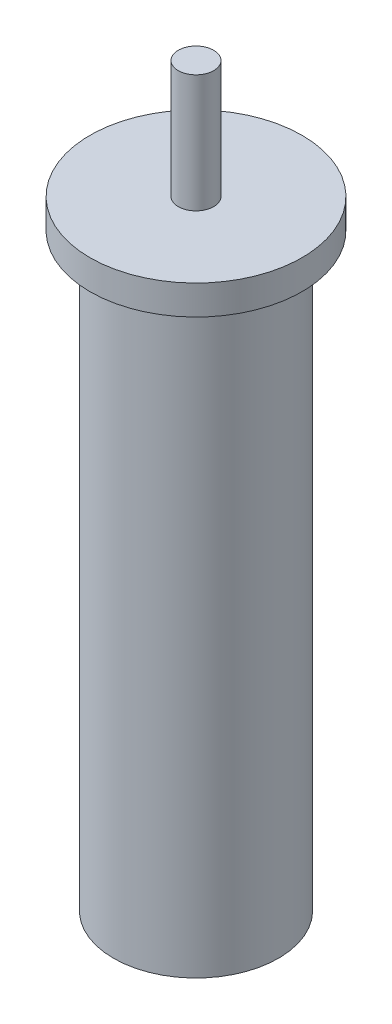
ISO-10303-21;
HEADER;
FILE_DESCRIPTION(('STEP AP214'),'2;1');
FILE_NAME('part.step','',(''),(''),'','','');
FILE_SCHEMA(('AUTOMOTIVE_DESIGN { 1 0 10303 214 1 1 1 1 }'));
ENDSEC;
DATA;
#1=APPLICATION_CONTEXT('core data for automotive mechanical design processes');
#2=APPLICATION_PROTOCOL_DEFINITION('international standard','automotive_design',2000,#1);
#3=PRODUCT_CONTEXT('',#1,'mechanical');
#4=PRODUCT('Part','Part','',(#3));
#5=PRODUCT_RELATED_PRODUCT_CATEGORY('part','',(#4));
#6=PRODUCT_DEFINITION_FORMATION('','',#4);
#7=PRODUCT_DEFINITION_CONTEXT('part definition',#1,'design');
#8=PRODUCT_DEFINITION('design','',#6,#7);
#9=PRODUCT_DEFINITION_SHAPE('','',#8);
#10=(LENGTH_UNIT() NAMED_UNIT(*) SI_UNIT(.MILLI.,.METRE.));
#11=(NAMED_UNIT(*) PLANE_ANGLE_UNIT() SI_UNIT($,.RADIAN.));
#12=(NAMED_UNIT(*) SI_UNIT($,.STERADIAN.) SOLID_ANGLE_UNIT());
#13=UNCERTAINTY_MEASURE_WITH_UNIT(LENGTH_MEASURE(1.E-05),#10,'distance_accuracy_value','');
#14=(GEOMETRIC_REPRESENTATION_CONTEXT(3) GLOBAL_UNCERTAINTY_ASSIGNED_CONTEXT((#13)) GLOBAL_UNIT_ASSIGNED_CONTEXT((#10,
#11,#12)) REPRESENTATION_CONTEXT('',''));
#15=CARTESIAN_POINT('',(0.,0.,0.));
#16=DIRECTION('',(0.,0.,1.));
#17=DIRECTION('',(1.,0.,0.));
#18=AXIS2_PLACEMENT_3D('',#15,#16,#17);
#19=CARTESIAN_POINT('',(0.,100.,0.));
#20=DIRECTION('',(0.,-1.,0.));
#21=DIRECTION('',(0.,0.,-1.));
#22=AXIS2_PLACEMENT_3D('',#19,#20,#21);
#23=CYLINDRICAL_SURFACE('',#22,14.);
#24=CARTESIAN_POINT('',(0.,100.,0.));
#25=DIRECTION('',(0.,1.,0.));
#26=DIRECTION('',(0.,0.,1.));
#27=AXIS2_PLACEMENT_3D('',#24,#25,#26);
#28=CIRCLE('',#27,14.);
#29=CARTESIAN_POINT('',(0.,100.,14.));
#30=VERTEX_POINT('',#29);
#31=EDGE_CURVE('E39',#30,#30,#28,.T.);
#32=ORIENTED_EDGE('',*,*,#31,.F.);
#33=EDGE_LOOP('',(#32));
#34=FACE_BOUND('',#33,.T.);
#35=CARTESIAN_POINT('',(0.,0.,0.));
#36=DIRECTION('',(0.,1.,0.));
#37=DIRECTION('',(0.,0.,1.));
#38=AXIS2_PLACEMENT_3D('',#35,#36,#37);
#39=CIRCLE('',#38,14.);
#40=CARTESIAN_POINT('',(0.,0.,14.));
#41=VERTEX_POINT('',#40);
#42=EDGE_CURVE('E35',#41,#41,#39,.T.);
#43=ORIENTED_EDGE('',*,*,#42,.T.);
#44=EDGE_LOOP('',(#43));
#45=FACE_BOUND('',#44,.T.);
#46=ADVANCED_FACE('F32',(#34,#45),#23,.T.);
#47=CARTESIAN_POINT('',(0.,0.,0.));
#48=DIRECTION('',(0.,1.,0.));
#49=DIRECTION('',(0.,0.,1.));
#50=AXIS2_PLACEMENT_3D('',#47,#48,#49);
#51=PLANE('',#50);
#52=ORIENTED_EDGE('',*,*,#42,.F.);
#53=EDGE_LOOP('',(#52));
#54=FACE_BOUND('',#53,.T.);
#55=ADVANCED_FACE('F73',(#54),#51,.F.);
#56=CARTESIAN_POINT('',(0.,105.,0.));
#57=DIRECTION('',(0.,-1.,0.));
#58=DIRECTION('',(0.,0.,-1.));
#59=AXIS2_PLACEMENT_3D('',#56,#57,#58);
#60=CYLINDRICAL_SURFACE('',#59,18.);
#61=CARTESIAN_POINT('',(0.,105.,0.));
#62=DIRECTION('',(0.,1.,0.));
#63=DIRECTION('',(0.,0.,1.));
#64=AXIS2_PLACEMENT_3D('',#61,#62,#63);
#65=CIRCLE('',#64,18.);
#66=CARTESIAN_POINT('',(0.,105.,18.));
#67=VERTEX_POINT('',#66);
#68=EDGE_CURVE('E47',#67,#67,#65,.T.);
#69=ORIENTED_EDGE('',*,*,#68,.F.);
#70=EDGE_LOOP('',(#69));
#71=FACE_BOUND('',#70,.T.);
#72=CARTESIAN_POINT('',(0.,100.,0.));
#73=DIRECTION('',(0.,1.,0.));
#74=DIRECTION('',(0.,0.,1.));
#75=AXIS2_PLACEMENT_3D('',#72,#73,#74);
#76=CIRCLE('',#75,18.);
#77=CARTESIAN_POINT('',(0.,100.,18.));
#78=VERTEX_POINT('',#77);
#79=EDGE_CURVE('E50',#78,#78,#76,.T.);
#80=ORIENTED_EDGE('',*,*,#79,.T.);
#81=EDGE_LOOP('',(#80));
#82=FACE_BOUND('',#81,.T.);
#83=ADVANCED_FACE('F78',(#71,#82),#60,.T.);
#84=CARTESIAN_POINT('',(0.,105.,0.));
#85=DIRECTION('',(0.,1.,0.));
#86=DIRECTION('',(0.,0.,1.));
#87=AXIS2_PLACEMENT_3D('',#84,#85,#86);
#88=PLANE('',#87);
#89=CARTESIAN_POINT('',(0.,105.,0.));
#90=DIRECTION('',(0.,1.,0.));
#91=DIRECTION('',(0.,0.,1.));
#92=AXIS2_PLACEMENT_3D('',#89,#90,#91);
#93=CIRCLE('',#92,3.);
#94=CARTESIAN_POINT('',(0.,105.,3.));
#95=VERTEX_POINT('',#94);
#96=EDGE_CURVE('E10',#95,#95,#93,.T.);
#97=ORIENTED_EDGE('',*,*,#96,.F.);
#98=EDGE_LOOP('',(#97));
#99=FACE_BOUND('',#98,.T.);
#100=ORIENTED_EDGE('',*,*,#68,.T.);
#101=EDGE_LOOP('',(#100));
#102=FACE_BOUND('',#101,.T.);
#103=ADVANCED_FACE('F68',(#99,#102),#88,.T.);
#104=CARTESIAN_POINT('',(0.,100.,0.));
#105=DIRECTION('',(0.,1.,0.));
#106=DIRECTION('',(0.,0.,1.));
#107=AXIS2_PLACEMENT_3D('',#104,#105,#106);
#108=PLANE('',#107);
#109=ORIENTED_EDGE('',*,*,#31,.T.);
#110=EDGE_LOOP('',(#109));
#111=FACE_BOUND('',#110,.T.);
#112=ORIENTED_EDGE('',*,*,#79,.F.);
#113=EDGE_LOOP('',(#112));
#114=FACE_BOUND('',#113,.T.);
#115=ADVANCED_FACE('F61',(#111,#114),#108,.F.);
#116=CARTESIAN_POINT('',(0.,125.,0.));
#117=DIRECTION('',(0.,-1.,0.));
#118=DIRECTION('',(0.,0.,-1.));
#119=AXIS2_PLACEMENT_3D('',#116,#117,#118);
#120=CYLINDRICAL_SURFACE('',#119,3.);
#121=CARTESIAN_POINT('',(0.,125.,0.));
#122=DIRECTION('',(0.,1.,0.));
#123=DIRECTION('',(0.,0.,1.));
#124=AXIS2_PLACEMENT_3D('',#121,#122,#123);
#125=CIRCLE('',#124,3.);
#126=CARTESIAN_POINT('',(0.,125.,3.));
#127=VERTEX_POINT('',#126);
#128=EDGE_CURVE('E46',#127,#127,#125,.T.);
#129=ORIENTED_EDGE('',*,*,#128,.F.);
#130=EDGE_LOOP('',(#129));
#131=FACE_BOUND('',#130,.T.);
#132=ORIENTED_EDGE('',*,*,#96,.T.);
#133=EDGE_LOOP('',(#132));
#134=FACE_BOUND('',#133,.T.);
#135=ADVANCED_FACE('F59',(#131,#134),#120,.T.);
#136=CARTESIAN_POINT('',(0.,125.,0.));
#137=DIRECTION('',(0.,1.,0.));
#138=DIRECTION('',(0.,0.,1.));
#139=AXIS2_PLACEMENT_3D('',#136,#137,#138);
#140=PLANE('',#139);
#141=ORIENTED_EDGE('',*,*,#128,.T.);
#142=EDGE_LOOP('',(#141));
#143=FACE_BOUND('',#142,.T.);
#144=ADVANCED_FACE('F57',(#143),#140,.T.);
#145=CLOSED_SHELL('',(#46,#55,#83,#103,#115,#135,#144));
#146=MANIFOLD_SOLID_BREP('B2',#145);
#147=ADVANCED_BREP_SHAPE_REPRESENTATION('',(#18,#146),#14);
#148=SHAPE_DEFINITION_REPRESENTATION(#9,#147);
ENDSEC;
END-ISO-10303-21;
